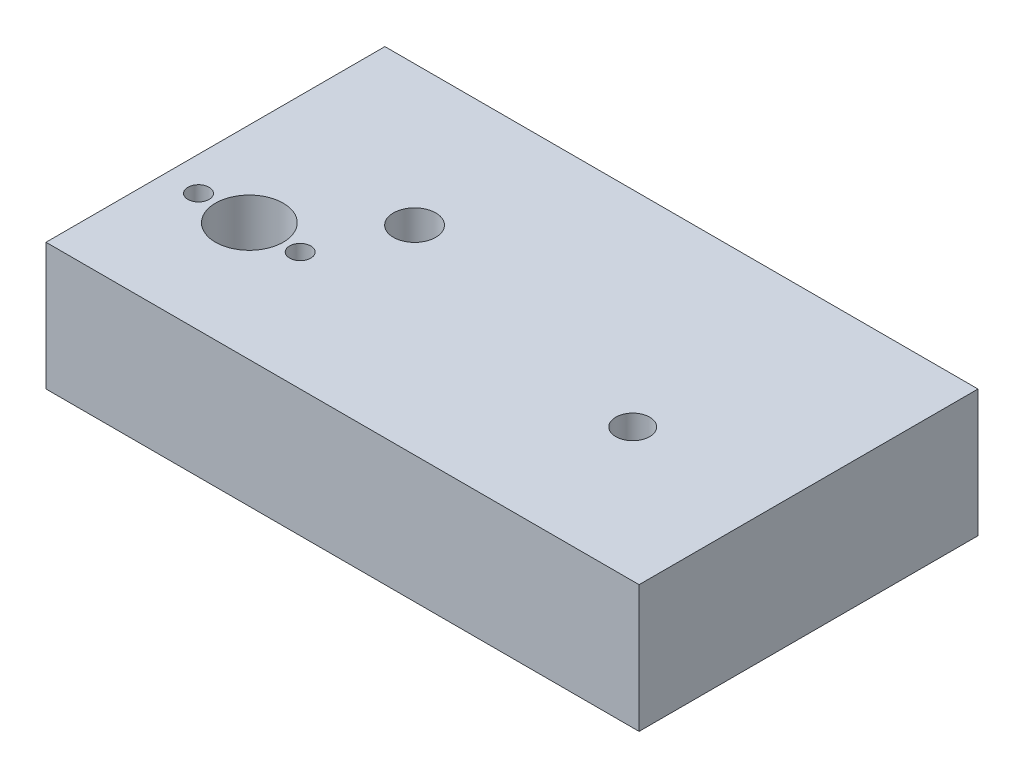
ISO-10303-21;
HEADER;
FILE_DESCRIPTION(('STEP AP214'),'2;1');
FILE_NAME('part.step','',(''),(''),'','','');
FILE_SCHEMA(('AUTOMOTIVE_DESIGN { 1 0 10303 214 1 1 1 1 }'));
ENDSEC;
DATA;
#1=APPLICATION_CONTEXT('core data for automotive mechanical design processes');
#2=APPLICATION_PROTOCOL_DEFINITION('international standard','automotive_design',2000,#1);
#3=PRODUCT_CONTEXT('',#1,'mechanical');
#4=PRODUCT('Part','Part','',(#3));
#5=PRODUCT_RELATED_PRODUCT_CATEGORY('part','',(#4));
#6=PRODUCT_DEFINITION_FORMATION('','',#4);
#7=PRODUCT_DEFINITION_CONTEXT('part definition',#1,'design');
#8=PRODUCT_DEFINITION('design','',#6,#7);
#9=PRODUCT_DEFINITION_SHAPE('','',#8);
#10=(LENGTH_UNIT() NAMED_UNIT(*) SI_UNIT(.MILLI.,.METRE.));
#11=(NAMED_UNIT(*) PLANE_ANGLE_UNIT() SI_UNIT($,.RADIAN.));
#12=(NAMED_UNIT(*) SI_UNIT($,.STERADIAN.) SOLID_ANGLE_UNIT());
#13=UNCERTAINTY_MEASURE_WITH_UNIT(LENGTH_MEASURE(1.E-05),#10,'distance_accuracy_value','');
#14=(GEOMETRIC_REPRESENTATION_CONTEXT(3) GLOBAL_UNCERTAINTY_ASSIGNED_CONTEXT((#13)) GLOBAL_UNIT_ASSIGNED_CONTEXT((#10,
#11,#12)) REPRESENTATION_CONTEXT('',''));
#15=CARTESIAN_POINT('',(0.,0.,0.));
#16=DIRECTION('',(0.,0.,1.));
#17=DIRECTION('',(1.,0.,0.));
#18=AXIS2_PLACEMENT_3D('',#15,#16,#17);
#19=CARTESIAN_POINT('',(-25.1303155006859,3.64128943758573,52.));
#20=DIRECTION('',(0.,-1.,0.));
#21=DIRECTION('',(0.,0.,-1.));
#22=AXIS2_PLACEMENT_3D('',#19,#20,#21);
#23=CYLINDRICAL_SURFACE('',#22,10.);
#24=CARTESIAN_POINT('',(-25.1303155006859,3.64128943758573,52.));
#25=DIRECTION('',(0.,-1.,0.));
#26=DIRECTION('',(0.,0.,-1.));
#27=AXIS2_PLACEMENT_3D('',#24,#25,#26);
#28=CIRCLE('',#27,10.);
#29=CARTESIAN_POINT('',(-35.0365655006859,3.64128943758574,50.6339066878504));
#30=VERTEX_POINT('',#29);
#31=CARTESIAN_POINT('',(-28.2547202341348,3.64128943758573,42.5006265963695));
#32=VERTEX_POINT('',#31);
#33=EDGE_CURVE('E136',#30,#32,#28,.T.);
#34=ORIENTED_EDGE('',*,*,#33,.F.);
#35=DIRECTION('',(0.,1.,0.));
#36=VECTOR('',#35,1.);
#37=CARTESIAN_POINT('',(-35.0365655006859,-26.8587105624143,50.6339066878504));
#38=LINE('',#37,#36);
#39=CARTESIAN_POINT('',(-35.0365655006859,-6.85871056241427,50.6339066878504));
#40=VERTEX_POINT('',#39);
#41=EDGE_CURVE('E11',#30,#40,#38,.F.);
#42=ORIENTED_EDGE('',*,*,#41,.T.);
#43=CARTESIAN_POINT('',(-25.1303155006859,-6.85871056241427,52.));
#44=DIRECTION('',(0.,-1.,0.));
#45=DIRECTION('',(0.,0.,-1.));
#46=AXIS2_PLACEMENT_3D('',#43,#44,#45);
#47=CIRCLE('',#46,10.);
#48=CARTESIAN_POINT('',(-28.2547202341348,-6.85871056241427,42.5006265963695));
#49=VERTEX_POINT('',#48);
#50=EDGE_CURVE('E129',#40,#49,#47,.T.);
#51=ORIENTED_EDGE('',*,*,#50,.T.);
#52=DIRECTION('',(0.,-1.,0.));
#53=VECTOR('',#52,1.);
#54=CARTESIAN_POINT('',(-28.2547202341348,-1.60871056241427,42.5006265963695));
#55=LINE('',#54,#53);
#56=EDGE_CURVE('E145',#32,#49,#55,.T.);
#57=ORIENTED_EDGE('',*,*,#56,.F.);
#58=EDGE_LOOP('',(#34,#42,#51,#57));
#59=FACE_BOUND('',#58,.T.);
#60=ADVANCED_FACE('F39',(#59),#23,.F.);
#61=CARTESIAN_POINT('',(-25.1303155006859,93.1412894375857,52.));
#62=DIRECTION('',(0.,-1.,0.));
#63=DIRECTION('',(0.,0.,-1.));
#64=AXIS2_PLACEMENT_3D('',#61,#62,#63);
#65=CYLINDRICAL_SURFACE('',#64,8.);
#66=CARTESIAN_POINT('',(-25.1303155006859,23.1412894375857,52.));
#67=DIRECTION('',(0.,-1.,0.));
#68=DIRECTION('',(0.,0.,-1.));
#69=AXIS2_PLACEMENT_3D('',#66,#67,#68);
#70=CIRCLE('',#69,8.);
#71=CARTESIAN_POINT('',(-25.1303155006859,23.1412894375857,44.));
#72=VERTEX_POINT('',#71);
#73=EDGE_CURVE('E149',#72,#72,#70,.T.);
#74=ORIENTED_EDGE('',*,*,#73,.F.);
#75=EDGE_LOOP('',(#74));
#76=FACE_BOUND('',#75,.T.);
#77=CARTESIAN_POINT('',(-25.1303155006859,3.64128943758574,52.));
#78=DIRECTION('',(0.,-1.,0.));
#79=DIRECTION('',(0.,0.,-1.));
#80=AXIS2_PLACEMENT_3D('',#77,#78,#79);
#81=CIRCLE('',#80,8.);
#82=CARTESIAN_POINT('',(-25.1303155006859,3.64128943758574,44.));
#83=VERTEX_POINT('',#82);
#84=EDGE_CURVE('E120',#83,#83,#81,.T.);
#85=ORIENTED_EDGE('',*,*,#84,.T.);
#86=EDGE_LOOP('',(#85));
#87=FACE_BOUND('',#86,.T.);
#88=ADVANCED_FACE('F223',(#76,#87),#65,.F.);
#89=CARTESIAN_POINT('',(-45.1303155006859,23.1412894375857,80.));
#90=DIRECTION('',(1.,0.,0.));
#91=DIRECTION('',(0.,0.,-1.));
#92=AXIS2_PLACEMENT_3D('',#89,#90,#91);
#93=PLANE('',#92);
#94=DIRECTION('',(0.,-1.,0.));
#95=VECTOR('',#94,1.);
#96=CARTESIAN_POINT('',(-45.1303155006859,23.1412894375857,0.));
#97=LINE('',#96,#95);
#98=CARTESIAN_POINT('',(-45.1303155006859,23.1412894375857,0.));
#99=VERTEX_POINT('',#98);
#100=CARTESIAN_POINT('',(-45.1303155006859,-6.85871056241427,0.));
#101=VERTEX_POINT('',#100);
#102=EDGE_CURVE('E178',#99,#101,#97,.T.);
#103=ORIENTED_EDGE('',*,*,#102,.T.);
#104=DIRECTION('',(0.,0.,-1.));
#105=VECTOR('',#104,1.);
#106=CARTESIAN_POINT('',(-45.1303155006859,-6.85871056241427,80.));
#107=LINE('',#106,#105);
#108=CARTESIAN_POINT('',(-45.1303155006859,-6.85871056241427,80.));
#109=VERTEX_POINT('',#108);
#110=EDGE_CURVE('E213',#109,#101,#107,.T.);
#111=ORIENTED_EDGE('',*,*,#110,.F.);
#112=DIRECTION('',(0.,-1.,0.));
#113=VECTOR('',#112,1.);
#114=CARTESIAN_POINT('',(-45.1303155006859,23.1412894375857,80.));
#115=LINE('',#114,#113);
#116=CARTESIAN_POINT('',(-45.1303155006859,23.1412894375857,80.));
#117=VERTEX_POINT('',#116);
#118=EDGE_CURVE('E182',#117,#109,#115,.T.);
#119=ORIENTED_EDGE('',*,*,#118,.F.);
#120=DIRECTION('',(0.,0.,-1.));
#121=VECTOR('',#120,1.);
#122=CARTESIAN_POINT('',(-45.1303155006859,23.1412894375857,80.));
#123=LINE('',#122,#121);
#124=EDGE_CURVE('E192',#117,#99,#123,.T.);
#125=ORIENTED_EDGE('',*,*,#124,.T.);
#126=EDGE_LOOP('',(#103,#111,#119,#125));
#127=FACE_BOUND('',#126,.T.);
#128=ADVANCED_FACE('F41',(#127),#93,.F.);
#129=CARTESIAN_POINT('',(-45.1303155006859,-6.85871056241427,80.));
#130=DIRECTION('',(0.,1.,0.));
#131=DIRECTION('',(0.,0.,1.));
#132=AXIS2_PLACEMENT_3D('',#129,#130,#131);
#133=PLANE('',#132);
#134=CARTESIAN_POINT('',(61.8696844993142,-6.85871056241427,48.5));
#135=DIRECTION('',(0.,1.,0.));
#136=DIRECTION('',(0.,0.,1.));
#137=AXIS2_PLACEMENT_3D('',#134,#135,#136);
#138=CIRCLE('',#137,4.00000000000001);
#139=CARTESIAN_POINT('',(61.8696844993142,-6.85871056241427,52.5));
#140=VERTEX_POINT('',#139);
#141=EDGE_CURVE('E289',#140,#140,#138,.T.);
#142=ORIENTED_EDGE('',*,*,#141,.T.);
#143=EDGE_LOOP('',(#142));
#144=FACE_BOUND('',#143,.T.);
#145=ORIENTED_EDGE('',*,*,#50,.F.);
#146=CARTESIAN_POINT('',(-37.1303155006859,-6.85871056241427,52.));
#147=DIRECTION('',(0.,1.,0.));
#148=DIRECTION('',(0.,0.,1.));
#149=AXIS2_PLACEMENT_3D('',#146,#147,#148);
#150=CIRCLE('',#149,2.5);
#151=CARTESIAN_POINT('',(-35.0365655006859,-6.85871056241426,53.3660933121497));
#152=VERTEX_POINT('',#151);
#153=EDGE_CURVE('E115',#40,#152,#150,.T.);
#154=ORIENTED_EDGE('',*,*,#153,.T.);
#155=CARTESIAN_POINT('',(-15.8035454584327,-6.85871056241427,55.6071263602665));
#156=VERTEX_POINT('',#155);
#157=EDGE_CURVE('E127',#156,#152,#47,.T.);
#158=ORIENTED_EDGE('',*,*,#157,.F.);
#159=CARTESIAN_POINT('',(-5.13031550068586,-6.85871056241427,33.));
#160=DIRECTION('',(0.,-1.,0.));
#161=DIRECTION('',(0.,0.,-1.));
#162=AXIS2_PLACEMENT_3D('',#159,#160,#161);
#163=CIRCLE('',#162,25.);
#164=EDGE_CURVE('E158',#49,#156,#163,.T.);
#165=ORIENTED_EDGE('',*,*,#164,.F.);
#166=EDGE_LOOP('',(#145,#154,#158,#165));
#167=FACE_BOUND('',#166,.T.);
#168=DIRECTION('',(1.,0.,0.));
#169=VECTOR('',#168,1.);
#170=CARTESIAN_POINT('',(-45.1303155006859,-6.85871056241427,0.));
#171=LINE('',#170,#169);
#172=CARTESIAN_POINT('',(94.8696844993142,-6.85871056241427,0.));
#173=VERTEX_POINT('',#172);
#174=EDGE_CURVE('E196',#101,#173,#171,.T.);
#175=ORIENTED_EDGE('',*,*,#174,.T.);
#176=DIRECTION('',(0.,0.,-1.));
#177=VECTOR('',#176,1.);
#178=CARTESIAN_POINT('',(94.8696844993142,-6.85871056241427,80.));
#179=LINE('',#178,#177);
#180=CARTESIAN_POINT('',(94.8696844993142,-6.85871056241427,80.));
#181=VERTEX_POINT('',#180);
#182=EDGE_CURVE('E209',#181,#173,#179,.T.);
#183=ORIENTED_EDGE('',*,*,#182,.F.);
#184=DIRECTION('',(1.,0.,0.));
#185=VECTOR('',#184,1.);
#186=CARTESIAN_POINT('',(-45.1303155006859,-6.85871056241427,80.));
#187=LINE('',#186,#185);
#188=EDGE_CURVE('E94',#109,#181,#187,.T.);
#189=ORIENTED_EDGE('',*,*,#188,.F.);
#190=ORIENTED_EDGE('',*,*,#110,.T.);
#191=EDGE_LOOP('',(#175,#183,#189,#190));
#192=FACE_BOUND('',#191,.T.);
#193=ADVANCED_FACE('F125',(#144,#167,#192),#133,.F.);
#194=CARTESIAN_POINT('',(94.8696844993142,23.1412894375857,80.));
#195=DIRECTION('',(-1.,0.,0.));
#196=DIRECTION('',(0.,0.,1.));
#197=AXIS2_PLACEMENT_3D('',#194,#195,#196);
#198=PLANE('',#197);
#199=DIRECTION('',(0.,1.,0.));
#200=VECTOR('',#199,1.);
#201=CARTESIAN_POINT('',(94.8696844993142,23.1412894375857,0.));
#202=LINE('',#201,#200);
#203=CARTESIAN_POINT('',(94.8696844993142,23.1412894375857,0.));
#204=VERTEX_POINT('',#203);
#205=EDGE_CURVE('E199',#173,#204,#202,.T.);
#206=ORIENTED_EDGE('',*,*,#205,.T.);
#207=DIRECTION('',(0.,0.,-1.));
#208=VECTOR('',#207,1.);
#209=CARTESIAN_POINT('',(94.8696844993142,23.1412894375857,80.));
#210=LINE('',#209,#208);
#211=CARTESIAN_POINT('',(94.8696844993142,23.1412894375857,80.));
#212=VERTEX_POINT('',#211);
#213=EDGE_CURVE('E206',#212,#204,#210,.T.);
#214=ORIENTED_EDGE('',*,*,#213,.F.);
#215=DIRECTION('',(0.,1.,0.));
#216=VECTOR('',#215,1.);
#217=CARTESIAN_POINT('',(94.8696844993142,23.1412894375857,80.));
#218=LINE('',#217,#216);
#219=EDGE_CURVE('E187',#181,#212,#218,.T.);
#220=ORIENTED_EDGE('',*,*,#219,.F.);
#221=ORIENTED_EDGE('',*,*,#182,.T.);
#222=EDGE_LOOP('',(#206,#214,#220,#221));
#223=FACE_BOUND('',#222,.T.);
#224=ADVANCED_FACE('F242',(#223),#198,.F.);
#225=CARTESIAN_POINT('',(-45.1303155006859,23.1412894375857,80.));
#226=DIRECTION('',(0.,-1.,0.));
#227=DIRECTION('',(0.,0.,-1.));
#228=AXIS2_PLACEMENT_3D('',#225,#226,#227);
#229=PLANE('',#228);
#230=CARTESIAN_POINT('',(61.8696844993142,23.1412894375857,48.5));
#231=DIRECTION('',(0.,1.,0.));
#232=DIRECTION('',(0.,0.,1.));
#233=AXIS2_PLACEMENT_3D('',#230,#231,#232);
#234=CIRCLE('',#233,4.00000000000001);
#235=CARTESIAN_POINT('',(61.8696844993142,23.1412894375857,52.5));
#236=VERTEX_POINT('',#235);
#237=EDGE_CURVE('E286',#236,#236,#234,.T.);
#238=ORIENTED_EDGE('',*,*,#237,.F.);
#239=EDGE_LOOP('',(#238));
#240=FACE_BOUND('',#239,.T.);
#241=CARTESIAN_POINT('',(-13.1303155006859,23.1412894375857,52.));
#242=DIRECTION('',(0.,1.,0.));
#243=DIRECTION('',(0.,0.,1.));
#244=AXIS2_PLACEMENT_3D('',#241,#242,#243);
#245=CIRCLE('',#244,2.5);
#246=CARTESIAN_POINT('',(-13.1303155006859,23.1412894375857,54.5));
#247=VERTEX_POINT('',#246);
#248=EDGE_CURVE('E292',#247,#247,#245,.T.);
#249=ORIENTED_EDGE('',*,*,#248,.F.);
#250=EDGE_LOOP('',(#249));
#251=FACE_BOUND('',#250,.T.);
#252=CARTESIAN_POINT('',(-37.1303155006859,23.1412894375857,52.));
#253=DIRECTION('',(0.,1.,0.));
#254=DIRECTION('',(0.,0.,1.));
#255=AXIS2_PLACEMENT_3D('',#252,#253,#254);
#256=CIRCLE('',#255,2.5);
#257=CARTESIAN_POINT('',(-37.1303155006859,23.1412894375857,54.5));
#258=VERTEX_POINT('',#257);
#259=EDGE_CURVE('E300',#258,#258,#256,.T.);
#260=ORIENTED_EDGE('',*,*,#259,.F.);
#261=EDGE_LOOP('',(#260));
#262=FACE_BOUND('',#261,.T.);
#263=ORIENTED_EDGE('',*,*,#73,.T.);
#264=EDGE_LOOP('',(#263));
#265=FACE_BOUND('',#264,.T.);
#266=CARTESIAN_POINT('',(-5.13031550068586,23.1412894375857,33.));
#267=DIRECTION('',(0.,-1.,0.));
#268=DIRECTION('',(0.,0.,-1.));
#269=AXIS2_PLACEMENT_3D('',#266,#267,#268);
#270=CIRCLE('',#269,5.);
#271=CARTESIAN_POINT('',(-5.13031550068586,23.1412894375857,28.));
#272=VERTEX_POINT('',#271);
#273=EDGE_CURVE('E154',#272,#272,#270,.F.);
#274=ORIENTED_EDGE('',*,*,#273,.F.);
#275=EDGE_LOOP('',(#274));
#276=FACE_BOUND('',#275,.T.);
#277=DIRECTION('',(-1.,0.,0.));
#278=VECTOR('',#277,1.);
#279=CARTESIAN_POINT('',(-45.1303155006859,23.1412894375857,0.));
#280=LINE('',#279,#278);
#281=EDGE_CURVE('E86',#204,#99,#280,.T.);
#282=ORIENTED_EDGE('',*,*,#281,.T.);
#283=ORIENTED_EDGE('',*,*,#124,.F.);
#284=DIRECTION('',(-1.,0.,0.));
#285=VECTOR('',#284,1.);
#286=CARTESIAN_POINT('',(-45.1303155006859,23.1412894375857,80.));
#287=LINE('',#286,#285);
#288=EDGE_CURVE('E65',#212,#117,#287,.T.);
#289=ORIENTED_EDGE('',*,*,#288,.F.);
#290=ORIENTED_EDGE('',*,*,#213,.T.);
#291=EDGE_LOOP('',(#282,#283,#289,#290));
#292=FACE_BOUND('',#291,.T.);
#293=ADVANCED_FACE('F239',(#240,#251,#262,#265,#276,#292),#229,.F.);
#294=CARTESIAN_POINT('',(0.,0.,80.));
#295=DIRECTION('',(0.,0.,1.));
#296=DIRECTION('',(1.,0.,0.));
#297=AXIS2_PLACEMENT_3D('',#294,#295,#296);
#298=PLANE('',#297);
#299=ORIENTED_EDGE('',*,*,#118,.T.);
#300=ORIENTED_EDGE('',*,*,#188,.T.);
#301=ORIENTED_EDGE('',*,*,#219,.T.);
#302=ORIENTED_EDGE('',*,*,#288,.T.);
#303=EDGE_LOOP('',(#299,#300,#301,#302));
#304=FACE_BOUND('',#303,.T.);
#305=ADVANCED_FACE('F241',(#304),#298,.T.);
#306=CARTESIAN_POINT('',(0.,0.,0.));
#307=DIRECTION('',(0.,0.,1.));
#308=DIRECTION('',(1.,0.,0.));
#309=AXIS2_PLACEMENT_3D('',#306,#307,#308);
#310=PLANE('',#309);
#311=CARTESIAN_POINT('',(79.8696844993141,7.81447199125043,0.));
#312=DIRECTION('',(0.,0.,-1.));
#313=DIRECTION('',(-1.,0.,0.));
#314=AXIS2_PLACEMENT_3D('',#311,#312,#313);
#315=CIRCLE('',#314,4.17592014993846);
#316=CARTESIAN_POINT('',(75.6937643493757,7.81447199125043,0.));
#317=VERTEX_POINT('',#316);
#318=EDGE_CURVE('E163',#317,#317,#315,.T.);
#319=ORIENTED_EDGE('',*,*,#318,.F.);
#320=EDGE_LOOP('',(#319));
#321=FACE_BOUND('',#320,.T.);
#322=CARTESIAN_POINT('',(-30.1303155006859,7.81447199125043,0.));
#323=DIRECTION('',(0.,0.,-1.));
#324=DIRECTION('',(-1.,0.,0.));
#325=AXIS2_PLACEMENT_3D('',#322,#323,#324);
#326=CIRCLE('',#325,4.17592014993846);
#327=CARTESIAN_POINT('',(-34.3062356506243,7.81447199125043,0.));
#328=VERTEX_POINT('',#327);
#329=EDGE_CURVE('E173',#328,#328,#326,.T.);
#330=ORIENTED_EDGE('',*,*,#329,.F.);
#331=EDGE_LOOP('',(#330));
#332=FACE_BOUND('',#331,.T.);
#333=ORIENTED_EDGE('',*,*,#102,.F.);
#334=ORIENTED_EDGE('',*,*,#281,.F.);
#335=ORIENTED_EDGE('',*,*,#205,.F.);
#336=ORIENTED_EDGE('',*,*,#174,.F.);
#337=EDGE_LOOP('',(#333,#334,#335,#336));
#338=FACE_BOUND('',#337,.T.);
#339=ADVANCED_FACE('F249',(#321,#332,#338),#310,.F.);
#340=CARTESIAN_POINT('',(-30.1303155006859,7.81447199125043,15.));
#341=DIRECTION('',(0.,0.,-1.));
#342=DIRECTION('',(-1.,0.,0.));
#343=AXIS2_PLACEMENT_3D('',#340,#341,#342);
#344=CYLINDRICAL_SURFACE('',#343,4.17592014993846);
#345=CARTESIAN_POINT('',(-30.1303155006859,7.81447199125043,15.));
#346=DIRECTION('',(0.,0.,-1.));
#347=DIRECTION('',(-1.,0.,0.));
#348=AXIS2_PLACEMENT_3D('',#345,#346,#347);
#349=CIRCLE('',#348,4.17592014993846);
#350=CARTESIAN_POINT('',(-34.3062356506243,7.81447199125043,15.));
#351=VERTEX_POINT('',#350);
#352=EDGE_CURVE('E174',#351,#351,#349,.T.);
#353=ORIENTED_EDGE('',*,*,#352,.F.);
#354=EDGE_LOOP('',(#353));
#355=FACE_BOUND('',#354,.T.);
#356=ORIENTED_EDGE('',*,*,#329,.T.);
#357=EDGE_LOOP('',(#356));
#358=FACE_BOUND('',#357,.T.);
#359=ADVANCED_FACE('F328',(#355,#358),#344,.F.);
#360=CARTESIAN_POINT('',(-30.1303155006859,7.81447199125043,15.));
#361=DIRECTION('',(0.,0.,-1.));
#362=DIRECTION('',(-1.,0.,0.));
#363=AXIS2_PLACEMENT_3D('',#360,#361,#362);
#364=PLANE('',#363);
#365=ORIENTED_EDGE('',*,*,#352,.T.);
#366=EDGE_LOOP('',(#365));
#367=FACE_BOUND('',#366,.T.);
#368=ADVANCED_FACE('F324',(#367),#364,.T.);
#369=CARTESIAN_POINT('',(79.8696844993141,7.81447199125043,15.));
#370=DIRECTION('',(0.,0.,-1.));
#371=DIRECTION('',(-1.,0.,0.));
#372=AXIS2_PLACEMENT_3D('',#369,#370,#371);
#373=CYLINDRICAL_SURFACE('',#372,4.17592014993846);
#374=CARTESIAN_POINT('',(79.8696844993141,7.81447199125043,15.));
#375=DIRECTION('',(0.,0.,-1.));
#376=DIRECTION('',(-1.,0.,0.));
#377=AXIS2_PLACEMENT_3D('',#374,#375,#376);
#378=CIRCLE('',#377,4.17592014993846);
#379=CARTESIAN_POINT('',(75.6937643493757,7.81447199125043,15.));
#380=VERTEX_POINT('',#379);
#381=EDGE_CURVE('E169',#380,#380,#378,.T.);
#382=ORIENTED_EDGE('',*,*,#381,.F.);
#383=EDGE_LOOP('',(#382));
#384=FACE_BOUND('',#383,.T.);
#385=ORIENTED_EDGE('',*,*,#318,.T.);
#386=EDGE_LOOP('',(#385));
#387=FACE_BOUND('',#386,.T.);
#388=ADVANCED_FACE('F318',(#384,#387),#373,.F.);
#389=CARTESIAN_POINT('',(79.8696844993141,7.81447199125043,15.));
#390=DIRECTION('',(0.,0.,-1.));
#391=DIRECTION('',(-1.,0.,0.));
#392=AXIS2_PLACEMENT_3D('',#389,#390,#391);
#393=PLANE('',#392);
#394=ORIENTED_EDGE('',*,*,#381,.T.);
#395=EDGE_LOOP('',(#394));
#396=FACE_BOUND('',#395,.T.);
#397=ADVANCED_FACE('F313',(#396),#393,.T.);
#398=CARTESIAN_POINT('',(-5.13031550068586,3.64128943758573,33.));
#399=DIRECTION('',(0.,-1.,0.));
#400=DIRECTION('',(0.,0.,-1.));
#401=AXIS2_PLACEMENT_3D('',#398,#399,#400);
#402=CYLINDRICAL_SURFACE('',#401,25.);
#403=CARTESIAN_POINT('',(-5.13031550068586,3.64128943758573,33.));
#404=DIRECTION('',(0.,-1.,0.));
#405=DIRECTION('',(0.,0.,-1.));
#406=AXIS2_PLACEMENT_3D('',#403,#404,#405);
#407=CIRCLE('',#406,25.);
#408=CARTESIAN_POINT('',(-15.8035454584327,3.64128943758573,55.6071263602665));
#409=VERTEX_POINT('',#408);
#410=EDGE_CURVE('E159',#32,#409,#407,.T.);
#411=ORIENTED_EDGE('',*,*,#410,.F.);
#412=ORIENTED_EDGE('',*,*,#56,.T.);
#413=ORIENTED_EDGE('',*,*,#164,.T.);
#414=DIRECTION('',(0.,-1.,0.));
#415=VECTOR('',#414,1.);
#416=CARTESIAN_POINT('',(-15.8035454584327,-1.60871056241427,55.6071263602665));
#417=LINE('',#416,#415);
#418=EDGE_CURVE('E134',#156,#409,#417,.F.);
#419=ORIENTED_EDGE('',*,*,#418,.T.);
#420=EDGE_LOOP('',(#411,#412,#413,#419));
#421=FACE_BOUND('',#420,.T.);
#422=ADVANCED_FACE('F229',(#421),#402,.F.);
#423=CARTESIAN_POINT('',(-5.13031550068586,3.64128943758573,33.));
#424=DIRECTION('',(0.,-1.,0.));
#425=DIRECTION('',(0.,0.,-1.));
#426=AXIS2_PLACEMENT_3D('',#423,#424,#425);
#427=PLANE('',#426);
#428=CARTESIAN_POINT('',(-13.1303155006859,3.64128943758574,52.));
#429=DIRECTION('',(0.,-1.,0.));
#430=DIRECTION('',(0.,0.,-1.));
#431=AXIS2_PLACEMENT_3D('',#428,#429,#430);
#432=CIRCLE('',#431,2.5);
#433=CARTESIAN_POINT('',(-13.1303155006859,3.64128943758574,49.5));
#434=VERTEX_POINT('',#433);
#435=EDGE_CURVE('E43',#434,#434,#432,.T.);
#436=ORIENTED_EDGE('',*,*,#435,.F.);
#437=EDGE_LOOP('',(#436));
#438=FACE_BOUND('',#437,.T.);
#439=CARTESIAN_POINT('',(-37.1303155006859,3.64128943758574,52.));
#440=DIRECTION('',(0.,-1.,0.));
#441=DIRECTION('',(0.,0.,-1.));
#442=AXIS2_PLACEMENT_3D('',#439,#440,#441);
#443=CIRCLE('',#442,2.5);
#444=CARTESIAN_POINT('',(-35.0365655006859,3.64128943758573,53.3660933121497));
#445=VERTEX_POINT('',#444);
#446=EDGE_CURVE('E56',#30,#445,#443,.T.);
#447=ORIENTED_EDGE('',*,*,#446,.F.);
#448=ORIENTED_EDGE('',*,*,#33,.T.);
#449=ORIENTED_EDGE('',*,*,#410,.T.);
#450=EDGE_CURVE('E140',#409,#445,#28,.T.);
#451=ORIENTED_EDGE('',*,*,#450,.T.);
#452=EDGE_LOOP('',(#447,#448,#449,#451));
#453=FACE_BOUND('',#452,.T.);
#454=ORIENTED_EDGE('',*,*,#84,.F.);
#455=EDGE_LOOP('',(#454));
#456=FACE_BOUND('',#455,.T.);
#457=CARTESIAN_POINT('',(-5.13031550068586,3.64128943758573,33.));
#458=DIRECTION('',(0.,-1.,0.));
#459=DIRECTION('',(0.,0.,-1.));
#460=AXIS2_PLACEMENT_3D('',#457,#458,#459);
#461=CIRCLE('',#460,5.);
#462=CARTESIAN_POINT('',(-5.13031550068586,3.64128943758573,28.));
#463=VERTEX_POINT('',#462);
#464=EDGE_CURVE('E153',#463,#463,#461,.F.);
#465=ORIENTED_EDGE('',*,*,#464,.T.);
#466=EDGE_LOOP('',(#465));
#467=FACE_BOUND('',#466,.T.);
#468=ADVANCED_FACE('F225',(#438,#453,#456,#467),#427,.T.);
#469=CARTESIAN_POINT('',(-5.13031550068586,-6.35871056241427,33.));
#470=DIRECTION('',(0.,1.,0.));
#471=DIRECTION('',(0.,0.,1.));
#472=AXIS2_PLACEMENT_3D('',#469,#470,#471);
#473=CYLINDRICAL_SURFACE('',#472,5.);
#474=ORIENTED_EDGE('',*,*,#464,.F.);
#475=EDGE_LOOP('',(#474));
#476=FACE_BOUND('',#475,.T.);
#477=ORIENTED_EDGE('',*,*,#273,.T.);
#478=EDGE_LOOP('',(#477));
#479=FACE_BOUND('',#478,.T.);
#480=ADVANCED_FACE('F228',(#476,#479),#473,.F.);
#481=ORIENTED_EDGE('',*,*,#157,.T.);
#482=DIRECTION('',(0.,1.,0.));
#483=VECTOR('',#482,1.);
#484=CARTESIAN_POINT('',(-35.0365655006859,-26.8587105624143,53.3660933121497));
#485=LINE('',#484,#483);
#486=EDGE_CURVE('E49',#152,#445,#485,.T.);
#487=ORIENTED_EDGE('',*,*,#486,.T.);
#488=ORIENTED_EDGE('',*,*,#450,.F.);
#489=ORIENTED_EDGE('',*,*,#418,.F.);
#490=EDGE_LOOP('',(#481,#487,#488,#489));
#491=FACE_BOUND('',#490,.T.);
#492=ADVANCED_FACE('F132',(#491),#23,.F.);
#493=CARTESIAN_POINT('',(-37.1303155006859,-76.8587105624143,52.));
#494=DIRECTION('',(0.,1.,0.));
#495=DIRECTION('',(0.,0.,1.));
#496=AXIS2_PLACEMENT_3D('',#493,#494,#495);
#497=CYLINDRICAL_SURFACE('',#496,2.5);
#498=ORIENTED_EDGE('',*,*,#259,.T.);
#499=EDGE_LOOP('',(#498));
#500=FACE_BOUND('',#499,.T.);
#501=ORIENTED_EDGE('',*,*,#446,.T.);
#502=ORIENTED_EDGE('',*,*,#486,.F.);
#503=ORIENTED_EDGE('',*,*,#153,.F.);
#504=ORIENTED_EDGE('',*,*,#41,.F.);
#505=EDGE_LOOP('',(#501,#502,#503,#504));
#506=FACE_BOUND('',#505,.T.);
#507=ADVANCED_FACE('F114',(#500,#506),#497,.F.);
#508=CARTESIAN_POINT('',(-13.1303155006859,-76.8587105624143,52.));
#509=DIRECTION('',(0.,1.,0.));
#510=DIRECTION('',(0.,0.,1.));
#511=AXIS2_PLACEMENT_3D('',#508,#509,#510);
#512=CYLINDRICAL_SURFACE('',#511,2.5);
#513=ORIENTED_EDGE('',*,*,#435,.T.);
#514=EDGE_LOOP('',(#513));
#515=FACE_BOUND('',#514,.T.);
#516=ORIENTED_EDGE('',*,*,#248,.T.);
#517=EDGE_LOOP('',(#516));
#518=FACE_BOUND('',#517,.T.);
#519=ADVANCED_FACE('F270',(#515,#518),#512,.F.);
#520=CARTESIAN_POINT('',(61.8696844993142,-76.8587105624143,48.5));
#521=DIRECTION('',(0.,1.,0.));
#522=DIRECTION('',(0.,0.,1.));
#523=AXIS2_PLACEMENT_3D('',#520,#521,#522);
#524=CYLINDRICAL_SURFACE('',#523,4.00000000000001);
#525=ORIENTED_EDGE('',*,*,#237,.T.);
#526=EDGE_LOOP('',(#525));
#527=FACE_BOUND('',#526,.T.);
#528=ORIENTED_EDGE('',*,*,#141,.F.);
#529=EDGE_LOOP('',(#528));
#530=FACE_BOUND('',#529,.T.);
#531=ADVANCED_FACE('F275',(#527,#530),#524,.F.);
#532=CLOSED_SHELL('',(#60,#88,#128,#193,#224,#293,#305,#339,#359,#368,#388,#397,#422,#468,#480,
#492,#507,#519,#531));
#533=MANIFOLD_SOLID_BREP('B2',#532);
#534=ADVANCED_BREP_SHAPE_REPRESENTATION('',(#18,#533),#14);
#535=SHAPE_DEFINITION_REPRESENTATION(#9,#534);
ENDSEC;
END-ISO-10303-21;
